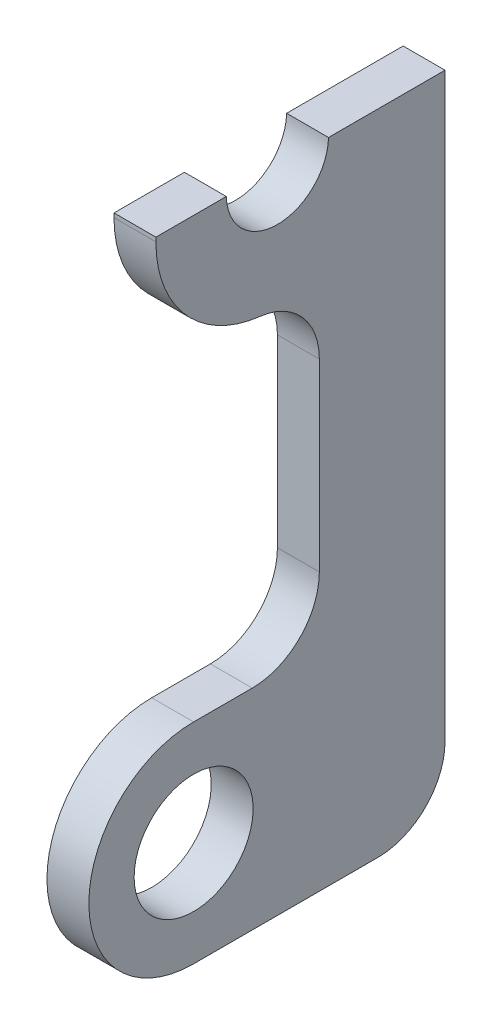
ISO-10303-21;
HEADER;
FILE_DESCRIPTION(('STEP AP214'),'2;1');
FILE_NAME('part.step','',(''),(''),'','','');
FILE_SCHEMA(('AUTOMOTIVE_DESIGN { 1 0 10303 214 1 1 1 1 }'));
ENDSEC;
DATA;
#1=APPLICATION_CONTEXT('core data for automotive mechanical design processes');
#2=APPLICATION_PROTOCOL_DEFINITION('international standard','automotive_design',2000,#1);
#3=PRODUCT_CONTEXT('',#1,'mechanical');
#4=PRODUCT('Part','Part','',(#3));
#5=PRODUCT_RELATED_PRODUCT_CATEGORY('part','',(#4));
#6=PRODUCT_DEFINITION_FORMATION('','',#4);
#7=PRODUCT_DEFINITION_CONTEXT('part definition',#1,'design');
#8=PRODUCT_DEFINITION('design','',#6,#7);
#9=PRODUCT_DEFINITION_SHAPE('','',#8);
#10=(LENGTH_UNIT() NAMED_UNIT(*) SI_UNIT(.MILLI.,.METRE.));
#11=(NAMED_UNIT(*) PLANE_ANGLE_UNIT() SI_UNIT($,.RADIAN.));
#12=(NAMED_UNIT(*) SI_UNIT($,.STERADIAN.) SOLID_ANGLE_UNIT());
#13=UNCERTAINTY_MEASURE_WITH_UNIT(LENGTH_MEASURE(1.E-05),#10,'distance_accuracy_value','');
#14=(GEOMETRIC_REPRESENTATION_CONTEXT(3) GLOBAL_UNCERTAINTY_ASSIGNED_CONTEXT((#13)) GLOBAL_UNIT_ASSIGNED_CONTEXT((#10,
#11,#12)) REPRESENTATION_CONTEXT('',''));
#15=CARTESIAN_POINT('',(0.,0.,0.));
#16=DIRECTION('',(0.,0.,1.));
#17=DIRECTION('',(1.,0.,0.));
#18=AXIS2_PLACEMENT_3D('',#15,#16,#17);
#19=CARTESIAN_POINT('',(5.,65.000000000002,-9.99999999999973));
#20=DIRECTION('',(-1.,0.,0.));
#21=DIRECTION('',(0.,0.,-1.00000000000002));
#22=AXIS2_PLACEMENT_3D('',#19,#20,#21);
#23=CYLINDRICAL_SURFACE('',#22,6.1);
#24=DIRECTION('',(-1.,0.,0.));
#25=VECTOR('',#24,1.);
#26=CARTESIAN_POINT('',(5.,64.8500000000018,-16.098155458825));
#27=LINE('',#26,#25);
#28=CARTESIAN_POINT('',(5.,64.8500000000018,-16.098155458825));
#29=VERTEX_POINT('',#28);
#30=CARTESIAN_POINT('',(0.,64.8500000000018,-16.098155458825));
#31=VERTEX_POINT('',#30);
#32=EDGE_CURVE('E160',#29,#31,#27,.T.);
#33=ORIENTED_EDGE('',*,*,#32,.T.);
#34=CARTESIAN_POINT('',(0.,65.000000000002,-9.99999999999973));
#35=DIRECTION('',(-1.,0.,0.));
#36=DIRECTION('',(0.,0.,1.00000000000002));
#37=AXIS2_PLACEMENT_3D('',#34,#35,#36);
#38=CIRCLE('',#37,6.1);
#39=CARTESIAN_POINT('',(0.,64.8500000000001,-3.90184454117448));
#40=VERTEX_POINT('',#39);
#41=EDGE_CURVE('E137',#31,#40,#38,.T.);
#42=ORIENTED_EDGE('',*,*,#41,.T.);
#43=DIRECTION('',(-1.,0.,0.));
#44=VECTOR('',#43,1.);
#45=CARTESIAN_POINT('',(5.,64.8500000000001,-3.90184454117448));
#46=LINE('',#45,#44);
#47=CARTESIAN_POINT('',(5.,64.8500000000001,-3.90184454117448));
#48=VERTEX_POINT('',#47);
#49=EDGE_CURVE('E405',#40,#48,#46,.F.);
#50=ORIENTED_EDGE('',*,*,#49,.T.);
#51=CARTESIAN_POINT('',(5.,65.000000000002,-9.99999999999973));
#52=DIRECTION('',(-1.,0.,0.));
#53=DIRECTION('',(0.,0.,1.00000000000002));
#54=AXIS2_PLACEMENT_3D('',#51,#52,#53);
#55=CIRCLE('',#54,6.1);
#56=EDGE_CURVE('E178',#29,#48,#55,.T.);
#57=ORIENTED_EDGE('',*,*,#56,.F.);
#58=EDGE_LOOP('',(#33,#42,#50,#57));
#59=FACE_BOUND('',#58,.T.);
#60=ADVANCED_FACE('F38',(#59),#23,.F.);
#61=CARTESIAN_POINT('',(5.,1.13797860024079E-12,-30.0000000000004));
#62=DIRECTION('',(0.,0.,-1.00000000000002));
#63=DIRECTION('',(1.,0.,0.));
#64=AXIS2_PLACEMENT_3D('',#61,#62,#63);
#65=PLANE('',#64);
#66=DIRECTION('',(0.,1.,0.));
#67=VECTOR('',#66,1.);
#68=CARTESIAN_POINT('',(0.,1.13797860024079E-12,-30.0000000000004));
#69=LINE('',#68,#67);
#70=CARTESIAN_POINT('',(0.,-4.49999999999905,-30.0000000000005));
#71=VERTEX_POINT('',#70);
#72=CARTESIAN_POINT('',(0.,64.8500000000006,-29.9999999999997));
#73=VERTEX_POINT('',#72);
#74=EDGE_CURVE('E135',#71,#73,#69,.T.);
#75=ORIENTED_EDGE('',*,*,#74,.T.);
#76=DIRECTION('',(1.,0.,0.));
#77=VECTOR('',#76,1.);
#78=CARTESIAN_POINT('',(0.,64.8500000000006,-29.9999999999997));
#79=LINE('',#78,#77);
#80=CARTESIAN_POINT('',(5.,64.8500000000006,-29.9999999999997));
#81=VERTEX_POINT('',#80);
#82=EDGE_CURVE('E141',#73,#81,#79,.T.);
#83=ORIENTED_EDGE('',*,*,#82,.T.);
#84=DIRECTION('',(0.,1.,0.));
#85=VECTOR('',#84,1.);
#86=CARTESIAN_POINT('',(5.,1.13797860024079E-12,-30.0000000000004));
#87=LINE('',#86,#85);
#88=CARTESIAN_POINT('',(5.,-4.49999999999905,-30.0000000000005));
#89=VERTEX_POINT('',#88);
#90=EDGE_CURVE('E397',#89,#81,#87,.T.);
#91=ORIENTED_EDGE('',*,*,#90,.F.);
#92=DIRECTION('',(-1.,0.,0.));
#93=VECTOR('',#92,1.);
#94=CARTESIAN_POINT('',(5.,-4.49999999999905,-30.0000000000005));
#95=LINE('',#94,#93);
#96=EDGE_CURVE('E154',#71,#89,#95,.F.);
#97=ORIENTED_EDGE('',*,*,#96,.F.);
#98=EDGE_LOOP('',(#75,#83,#91,#97));
#99=FACE_BOUND('',#98,.T.);
#100=ADVANCED_FACE('F152',(#99),#65,.T.);
#101=CARTESIAN_POINT('',(5.,-12.4999999999998,0.));
#102=DIRECTION('',(0.,1.,0.));
#103=DIRECTION('',(0.,0.,-1.00000000000002));
#104=AXIS2_PLACEMENT_3D('',#101,#102,#103);
#105=PLANE('',#104);
#106=DIRECTION('',(0.,0.,1.00000000000002));
#107=VECTOR('',#106,1.);
#108=CARTESIAN_POINT('',(5.,-12.4999999999998,0.));
#109=LINE('',#108,#107);
#110=CARTESIAN_POINT('',(5.,-12.4999999999991,-22.0000000000005));
#111=VERTEX_POINT('',#110);
#112=CARTESIAN_POINT('',(5.,-12.4999999999998,0.));
#113=VERTEX_POINT('',#112);
#114=EDGE_CURVE('E394',#111,#113,#109,.T.);
#115=ORIENTED_EDGE('',*,*,#114,.T.);
#116=DIRECTION('',(-1.,0.,0.));
#117=VECTOR('',#116,1.);
#118=CARTESIAN_POINT('',(5.,-12.4999999999998,0.));
#119=LINE('',#118,#117);
#120=CARTESIAN_POINT('',(0.,-12.4999999999998,0.));
#121=VERTEX_POINT('',#120);
#122=EDGE_CURVE('E182',#113,#121,#119,.T.);
#123=ORIENTED_EDGE('',*,*,#122,.T.);
#124=DIRECTION('',(0.,0.,1.00000000000002));
#125=VECTOR('',#124,1.);
#126=CARTESIAN_POINT('',(0.,-12.4999999999998,0.));
#127=LINE('',#126,#125);
#128=CARTESIAN_POINT('',(0.,-12.4999999999991,-22.0000000000005));
#129=VERTEX_POINT('',#128);
#130=EDGE_CURVE('E155',#129,#121,#127,.T.);
#131=ORIENTED_EDGE('',*,*,#130,.F.);
#132=DIRECTION('',(-1.,0.,0.));
#133=VECTOR('',#132,1.);
#134=CARTESIAN_POINT('',(0.,-12.4999999999991,-22.0000000000005));
#135=LINE('',#134,#133);
#136=EDGE_CURVE('E188',#111,#129,#135,.T.);
#137=ORIENTED_EDGE('',*,*,#136,.F.);
#138=EDGE_LOOP('',(#115,#123,#131,#137));
#139=FACE_BOUND('',#138,.T.);
#140=ADVANCED_FACE('F265',(#139),#105,.F.);
#141=CARTESIAN_POINT('',(5.,0.,0.));
#142=DIRECTION('',(-1.,0.,0.));
#143=DIRECTION('',(0.,0.,-1.00000000000002));
#144=AXIS2_PLACEMENT_3D('',#141,#142,#143);
#145=CYLINDRICAL_SURFACE('',#144,12.5);
#146=CARTESIAN_POINT('',(0.,0.,0.));
#147=DIRECTION('',(-1.,0.,0.));
#148=DIRECTION('',(0.,0.,1.00000000000002));
#149=AXIS2_PLACEMENT_3D('',#146,#147,#148);
#150=CIRCLE('',#149,12.5);
#151=CARTESIAN_POINT('',(0.,12.5,-1.59594559789866E-13));
#152=VERTEX_POINT('',#151);
#153=EDGE_CURVE('E158',#121,#152,#150,.T.);
#154=ORIENTED_EDGE('',*,*,#153,.F.);
#155=ORIENTED_EDGE('',*,*,#122,.F.);
#156=CARTESIAN_POINT('',(5.,0.,0.));
#157=DIRECTION('',(-1.,0.,0.));
#158=DIRECTION('',(0.,0.,1.00000000000002));
#159=AXIS2_PLACEMENT_3D('',#156,#157,#158);
#160=CIRCLE('',#159,12.5);
#161=CARTESIAN_POINT('',(5.,12.5,-1.59594559789866E-13));
#162=VERTEX_POINT('',#161);
#163=EDGE_CURVE('E235',#113,#162,#160,.T.);
#164=ORIENTED_EDGE('',*,*,#163,.T.);
#165=DIRECTION('',(-1.,0.,0.));
#166=VECTOR('',#165,1.);
#167=CARTESIAN_POINT('',(5.,12.5,-1.59594559789866E-13));
#168=LINE('',#167,#166);
#169=EDGE_CURVE('E179',#162,#152,#168,.T.);
#170=ORIENTED_EDGE('',*,*,#169,.T.);
#171=EDGE_LOOP('',(#154,#155,#164,#170));
#172=FACE_BOUND('',#171,.T.);
#173=ADVANCED_FACE('F356',(#172),#145,.T.);
#174=CARTESIAN_POINT('',(5.,12.5,-1.04083408558608E-13));
#175=DIRECTION('',(0.,-1.,0.));
#176=DIRECTION('',(0.,0.,1.00000000000002));
#177=AXIS2_PLACEMENT_3D('',#174,#175,#176);
#178=PLANE('',#177);
#179=DIRECTION('',(0.,0.,-1.00000000000002));
#180=VECTOR('',#179,1.);
#181=CARTESIAN_POINT('',(0.,12.5,-1.04083408558608E-13));
#182=LINE('',#181,#180);
#183=CARTESIAN_POINT('',(0.,12.5,-7.00000000000044));
#184=VERTEX_POINT('',#183);
#185=EDGE_CURVE('E166',#152,#184,#182,.T.);
#186=ORIENTED_EDGE('',*,*,#185,.F.);
#187=ORIENTED_EDGE('',*,*,#169,.F.);
#188=DIRECTION('',(0.,0.,-1.00000000000002));
#189=VECTOR('',#188,1.);
#190=CARTESIAN_POINT('',(5.,12.5,-1.04083408558608E-13));
#191=LINE('',#190,#189);
#192=CARTESIAN_POINT('',(5.,12.5,-7.00000000000044));
#193=VERTEX_POINT('',#192);
#194=EDGE_CURVE('E230',#162,#193,#191,.T.);
#195=ORIENTED_EDGE('',*,*,#194,.T.);
#196=DIRECTION('',(-1.,0.,0.));
#197=VECTOR('',#196,1.);
#198=CARTESIAN_POINT('',(5.,12.5,-7.00000000000044));
#199=LINE('',#198,#197);
#200=EDGE_CURVE('E202',#184,#193,#199,.F.);
#201=ORIENTED_EDGE('',*,*,#200,.F.);
#202=EDGE_LOOP('',(#186,#187,#195,#201));
#203=FACE_BOUND('',#202,.T.);
#204=ADVANCED_FACE('F348',(#203),#178,.F.);
#205=CARTESIAN_POINT('',(5.,1.13797860024079E-12,-15.0000000000003));
#206=DIRECTION('',(0.,0.,1.00000000000002));
#207=DIRECTION('',(0.,1.,0.));
#208=AXIS2_PLACEMENT_3D('',#205,#206,#207);
#209=PLANE('',#208);
#210=DIRECTION('',(0.,-1.,0.));
#211=VECTOR('',#210,1.);
#212=CARTESIAN_POINT('',(5.,1.13797860024079E-12,-15.0000000000003));
#213=LINE('',#212,#211);
#214=CARTESIAN_POINT('',(5.,42.500000000002,-15.0000000000003));
#215=VERTEX_POINT('',#214);
#216=CARTESIAN_POINT('',(5.,20.5000000000011,-15.0000000000003));
#217=VERTEX_POINT('',#216);
#218=EDGE_CURVE('E226',#215,#217,#213,.T.);
#219=ORIENTED_EDGE('',*,*,#218,.F.);
#220=DIRECTION('',(-1.,0.,0.));
#221=VECTOR('',#220,1.);
#222=CARTESIAN_POINT('',(5.,42.500000000002,-15.0000000000003));
#223=LINE('',#222,#221);
#224=CARTESIAN_POINT('',(0.,42.500000000002,-15.0000000000003));
#225=VERTEX_POINT('',#224);
#226=EDGE_CURVE('E196',#225,#215,#223,.F.);
#227=ORIENTED_EDGE('',*,*,#226,.F.);
#228=DIRECTION('',(0.,-1.,0.));
#229=VECTOR('',#228,1.);
#230=CARTESIAN_POINT('',(0.,1.13797860024079E-12,-15.0000000000003));
#231=LINE('',#230,#229);
#232=CARTESIAN_POINT('',(0.,20.5000000000011,-15.0000000000003));
#233=VERTEX_POINT('',#232);
#234=EDGE_CURVE('E169',#225,#233,#231,.T.);
#235=ORIENTED_EDGE('',*,*,#234,.T.);
#236=DIRECTION('',(-1.,0.,0.));
#237=VECTOR('',#236,1.);
#238=CARTESIAN_POINT('',(5.,20.5000000000011,-15.0000000000003));
#239=LINE('',#238,#237);
#240=EDGE_CURVE('E199',#217,#233,#239,.T.);
#241=ORIENTED_EDGE('',*,*,#240,.F.);
#242=EDGE_LOOP('',(#219,#227,#235,#241));
#243=FACE_BOUND('',#242,.T.);
#244=ADVANCED_FACE('F227',(#243),#209,.T.);
#245=CARTESIAN_POINT('',(5.,2.05391259555654E-12,4.5));
#246=DIRECTION('',(0.,0.,1.00000000000002));
#247=DIRECTION('',(0.,1.,0.));
#248=AXIS2_PLACEMENT_3D('',#245,#246,#247);
#249=PLANE('',#248);
#250=DIRECTION('',(0.,-1.,0.));
#251=VECTOR('',#250,1.);
#252=CARTESIAN_POINT('',(5.,2.05391259555654E-12,4.5));
#253=LINE('',#252,#251);
#254=CARTESIAN_POINT('',(5.,64.8500000000003,4.50000000000061));
#255=VERTEX_POINT('',#254);
#256=CARTESIAN_POINT('',(5.,64.3574929943947,4.50000000000061));
#257=VERTEX_POINT('',#256);
#258=EDGE_CURVE('E229',#255,#257,#253,.T.);
#259=ORIENTED_EDGE('',*,*,#258,.F.);
#260=DIRECTION('',(1.,0.,0.));
#261=VECTOR('',#260,1.);
#262=CARTESIAN_POINT('',(0.,64.8500000000003,4.50000000000061));
#263=LINE('',#262,#261);
#264=CARTESIAN_POINT('',(0.,64.8500000000003,4.50000000000061));
#265=VERTEX_POINT('',#264);
#266=EDGE_CURVE('E149',#265,#255,#263,.T.);
#267=ORIENTED_EDGE('',*,*,#266,.F.);
#268=DIRECTION('',(0.,-1.,0.));
#269=VECTOR('',#268,1.);
#270=CARTESIAN_POINT('',(0.,2.05391259555654E-12,4.5));
#271=LINE('',#270,#269);
#272=CARTESIAN_POINT('',(0.,64.3574929943947,4.50000000000061));
#273=VERTEX_POINT('',#272);
#274=EDGE_CURVE('E172',#265,#273,#271,.T.);
#275=ORIENTED_EDGE('',*,*,#274,.T.);
#276=DIRECTION('',(-1.,0.,0.));
#277=VECTOR('',#276,1.);
#278=CARTESIAN_POINT('',(0.,64.3574929943947,4.50000000000061));
#279=LINE('',#278,#277);
#280=EDGE_CURVE('E213',#257,#273,#279,.T.);
#281=ORIENTED_EDGE('',*,*,#280,.F.);
#282=EDGE_LOOP('',(#259,#267,#275,#281));
#283=FACE_BOUND('',#282,.T.);
#284=ADVANCED_FACE('F246',(#283),#249,.T.);
#285=CARTESIAN_POINT('',(5.,0.,0.));
#286=DIRECTION('',(-1.,0.,0.));
#287=DIRECTION('',(0.,0.,-1.00000000000002));
#288=AXIS2_PLACEMENT_3D('',#285,#286,#287);
#289=CYLINDRICAL_SURFACE('',#288,7.1);
#290=CARTESIAN_POINT('',(5.,0.,0.));
#291=DIRECTION('',(-1.,0.,0.));
#292=DIRECTION('',(0.,0.,1.00000000000002));
#293=AXIS2_PLACEMENT_3D('',#290,#291,#292);
#294=CIRCLE('',#293,7.1);
#295=CARTESIAN_POINT('',(5.,0.,7.10000000000007));
#296=VERTEX_POINT('',#295);
#297=EDGE_CURVE('E183',#296,#296,#294,.T.);
#298=ORIENTED_EDGE('',*,*,#297,.F.);
#299=EDGE_LOOP('',(#298));
#300=FACE_BOUND('',#299,.T.);
#301=CARTESIAN_POINT('',(0.,0.,0.));
#302=DIRECTION('',(-1.,0.,0.));
#303=DIRECTION('',(0.,0.,1.00000000000002));
#304=AXIS2_PLACEMENT_3D('',#301,#302,#303);
#305=CIRCLE('',#304,7.1);
#306=CARTESIAN_POINT('',(0.,0.,7.10000000000007));
#307=VERTEX_POINT('',#306);
#308=EDGE_CURVE('E175',#307,#307,#305,.T.);
#309=ORIENTED_EDGE('',*,*,#308,.T.);
#310=EDGE_LOOP('',(#309));
#311=FACE_BOUND('',#310,.T.);
#312=ADVANCED_FACE('F243',(#300,#311),#289,.F.);
#313=CARTESIAN_POINT('',(5.,0.,0.));
#314=DIRECTION('',(1.,0.,0.));
#315=DIRECTION('',(0.,0.,1.00000000000002));
#316=AXIS2_PLACEMENT_3D('',#313,#314,#315);
#317=PLANE('',#316);
#318=CARTESIAN_POINT('',(5.,42.5,-7.00000000000028));
#319=DIRECTION('',(-1.,0.,0.));
#320=DIRECTION('',(0.,0.,1.00000000000002));
#321=AXIS2_PLACEMENT_3D('',#318,#319,#320);
#322=CIRCLE('',#321,8.);
#323=CARTESIAN_POINT('',(5.,50.4481792706908,-7.9090909090903));
#324=VERTEX_POINT('',#323);
#325=EDGE_CURVE('E211',#215,#324,#322,.F.);
#326=ORIENTED_EDGE('',*,*,#325,.F.);
#327=ORIENTED_EDGE('',*,*,#218,.T.);
#328=CARTESIAN_POINT('',(5.,20.5,-7.00000000000023));
#329=DIRECTION('',(-1.,0.,0.));
#330=DIRECTION('',(0.,0.,1.00000000000002));
#331=AXIS2_PLACEMENT_3D('',#328,#329,#330);
#332=CIRCLE('',#331,8.);
#333=EDGE_CURVE('E207',#193,#217,#332,.F.);
#334=ORIENTED_EDGE('',*,*,#333,.F.);
#335=ORIENTED_EDGE('',*,*,#194,.F.);
#336=ORIENTED_EDGE('',*,*,#163,.F.);
#337=ORIENTED_EDGE('',*,*,#114,.F.);
#338=CARTESIAN_POINT('',(5.,-4.49999999999905,-22.0000000000003));
#339=DIRECTION('',(-1.,0.,0.));
#340=DIRECTION('',(0.,0.,1.00000000000002));
#341=AXIS2_PLACEMENT_3D('',#338,#339,#340);
#342=CIRCLE('',#341,8.);
#343=EDGE_CURVE('E194',#89,#111,#342,.T.);
#344=ORIENTED_EDGE('',*,*,#343,.F.);
#345=ORIENTED_EDGE('',*,*,#90,.T.);
#346=DIRECTION('',(0.,0.,1.00000000000002));
#347=VECTOR('',#346,1.);
#348=CARTESIAN_POINT('',(5.,64.8500000000006,-29.9999999999997));
#349=LINE('',#348,#347);
#350=EDGE_CURVE('E142',#81,#29,#349,.T.);
#351=ORIENTED_EDGE('',*,*,#350,.T.);
#352=ORIENTED_EDGE('',*,*,#56,.T.);
#353=EDGE_CURVE('E410',#48,#255,#349,.T.);
#354=ORIENTED_EDGE('',*,*,#353,.T.);
#355=ORIENTED_EDGE('',*,*,#258,.T.);
#356=CARTESIAN_POINT('',(5.,64.3574929943944,-9.49999999999973));
#357=DIRECTION('',(-1.,0.,0.));
#358=DIRECTION('',(0.,0.,1.00000000000002));
#359=AXIS2_PLACEMENT_3D('',#356,#357,#358);
#360=CIRCLE('',#359,14.);
#361=EDGE_CURVE('E11',#324,#257,#360,.T.);
#362=ORIENTED_EDGE('',*,*,#361,.F.);
#363=EDGE_LOOP('',(#326,#327,#334,#335,#336,#337,#344,#345,#351,#352,#354,#355,#362));
#364=FACE_BOUND('',#363,.T.);
#365=ORIENTED_EDGE('',*,*,#297,.T.);
#366=EDGE_LOOP('',(#365));
#367=FACE_BOUND('',#366,.T.);
#368=ADVANCED_FACE('F241',(#364,#367),#317,.T.);
#369=CARTESIAN_POINT('',(0.,0.,0.));
#370=DIRECTION('',(1.,0.,0.));
#371=DIRECTION('',(0.,0.,1.00000000000002));
#372=AXIS2_PLACEMENT_3D('',#369,#370,#371);
#373=PLANE('',#372);
#374=ORIENTED_EDGE('',*,*,#274,.F.);
#375=DIRECTION('',(0.,0.,1.00000000000002));
#376=VECTOR('',#375,1.);
#377=CARTESIAN_POINT('',(0.,64.85,6.10622663543836E-13));
#378=LINE('',#377,#376);
#379=EDGE_CURVE('E186',#40,#265,#378,.T.);
#380=ORIENTED_EDGE('',*,*,#379,.F.);
#381=ORIENTED_EDGE('',*,*,#41,.F.);
#382=DIRECTION('',(0.,0.,1.00000000000002));
#383=VECTOR('',#382,1.);
#384=CARTESIAN_POINT('',(0.,64.8500000000006,-29.9999999999997));
#385=LINE('',#384,#383);
#386=EDGE_CURVE('E129',#73,#31,#385,.T.);
#387=ORIENTED_EDGE('',*,*,#386,.F.);
#388=ORIENTED_EDGE('',*,*,#74,.F.);
#389=CARTESIAN_POINT('',(0.,-4.49999999999905,-22.0000000000003));
#390=DIRECTION('',(-1.,0.,0.));
#391=DIRECTION('',(0.,0.,1.00000000000002));
#392=AXIS2_PLACEMENT_3D('',#389,#390,#391);
#393=CIRCLE('',#392,8.);
#394=EDGE_CURVE('E191',#129,#71,#393,.F.);
#395=ORIENTED_EDGE('',*,*,#394,.F.);
#396=ORIENTED_EDGE('',*,*,#130,.T.);
#397=ORIENTED_EDGE('',*,*,#153,.T.);
#398=ORIENTED_EDGE('',*,*,#185,.T.);
#399=CARTESIAN_POINT('',(0.,20.5,-7.00000000000023));
#400=DIRECTION('',(-1.,0.,0.));
#401=DIRECTION('',(0.,0.,1.00000000000002));
#402=AXIS2_PLACEMENT_3D('',#399,#400,#401);
#403=CIRCLE('',#402,8.);
#404=EDGE_CURVE('E205',#233,#184,#403,.T.);
#405=ORIENTED_EDGE('',*,*,#404,.F.);
#406=ORIENTED_EDGE('',*,*,#234,.F.);
#407=CARTESIAN_POINT('',(0.,42.5,-7.00000000000028));
#408=DIRECTION('',(-1.,0.,0.));
#409=DIRECTION('',(0.,0.,1.00000000000002));
#410=AXIS2_PLACEMENT_3D('',#407,#408,#409);
#411=CIRCLE('',#410,8.);
#412=CARTESIAN_POINT('',(0.,50.4481792706908,-7.9090909090903));
#413=VERTEX_POINT('',#412);
#414=EDGE_CURVE('E209',#413,#225,#411,.T.);
#415=ORIENTED_EDGE('',*,*,#414,.F.);
#416=CARTESIAN_POINT('',(0.,64.3574929943944,-9.49999999999973));
#417=DIRECTION('',(-1.,0.,0.));
#418=DIRECTION('',(0.,0.,1.00000000000002));
#419=AXIS2_PLACEMENT_3D('',#416,#417,#418);
#420=CIRCLE('',#419,14.);
#421=EDGE_CURVE('E216',#273,#413,#420,.F.);
#422=ORIENTED_EDGE('',*,*,#421,.F.);
#423=EDGE_LOOP('',(#374,#380,#381,#387,#388,#395,#396,#397,#398,#405,#406,#415,#422));
#424=FACE_BOUND('',#423,.T.);
#425=ORIENTED_EDGE('',*,*,#308,.F.);
#426=EDGE_LOOP('',(#425));
#427=FACE_BOUND('',#426,.T.);
#428=ADVANCED_FACE('F132',(#424,#427),#373,.F.);
#429=CARTESIAN_POINT('',(0.,64.8500000000006,-29.9999999999997));
#430=DIRECTION('',(0.,-1.,0.));
#431=DIRECTION('',(0.,0.,1.00000000000002));
#432=AXIS2_PLACEMENT_3D('',#429,#430,#431);
#433=PLANE('',#432);
#434=ORIENTED_EDGE('',*,*,#49,.F.);
#435=ORIENTED_EDGE('',*,*,#379,.T.);
#436=ORIENTED_EDGE('',*,*,#266,.T.);
#437=ORIENTED_EDGE('',*,*,#353,.F.);
#438=EDGE_LOOP('',(#434,#435,#436,#437));
#439=FACE_BOUND('',#438,.T.);
#440=ADVANCED_FACE('F250',(#439),#433,.F.);
#441=ORIENTED_EDGE('',*,*,#32,.F.);
#442=ORIENTED_EDGE('',*,*,#350,.F.);
#443=ORIENTED_EDGE('',*,*,#82,.F.);
#444=ORIENTED_EDGE('',*,*,#386,.T.);
#445=EDGE_LOOP('',(#441,#442,#443,#444));
#446=FACE_BOUND('',#445,.T.);
#447=ADVANCED_FACE('F145',(#446),#433,.F.);
#448=CARTESIAN_POINT('',(5.,-4.49999999999905,-22.0000000000003));
#449=DIRECTION('',(1.,0.,0.));
#450=DIRECTION('',(0.,0.,1.00000000000002));
#451=AXIS2_PLACEMENT_3D('',#448,#449,#450);
#452=CYLINDRICAL_SURFACE('',#451,8.);
#453=ORIENTED_EDGE('',*,*,#343,.T.);
#454=ORIENTED_EDGE('',*,*,#136,.T.);
#455=ORIENTED_EDGE('',*,*,#394,.T.);
#456=ORIENTED_EDGE('',*,*,#96,.T.);
#457=EDGE_LOOP('',(#453,#454,#455,#456));
#458=FACE_BOUND('',#457,.T.);
#459=ADVANCED_FACE('F269',(#458),#452,.T.);
#460=CARTESIAN_POINT('',(5.,20.5,-7.00000000000023));
#461=DIRECTION('',(-1.,0.,0.));
#462=DIRECTION('',(0.,0.,-1.00000000000002));
#463=AXIS2_PLACEMENT_3D('',#460,#461,#462);
#464=CYLINDRICAL_SURFACE('',#463,8.);
#465=ORIENTED_EDGE('',*,*,#333,.T.);
#466=ORIENTED_EDGE('',*,*,#240,.T.);
#467=ORIENTED_EDGE('',*,*,#404,.T.);
#468=ORIENTED_EDGE('',*,*,#200,.T.);
#469=EDGE_LOOP('',(#465,#466,#467,#468));
#470=FACE_BOUND('',#469,.T.);
#471=ADVANCED_FACE('F272',(#470),#464,.F.);
#472=CARTESIAN_POINT('',(5.,42.5,-7.00000000000028));
#473=DIRECTION('',(1.,0.,0.));
#474=DIRECTION('',(0.,0.,1.00000000000002));
#475=AXIS2_PLACEMENT_3D('',#472,#473,#474);
#476=CYLINDRICAL_SURFACE('',#475,8.);
#477=ORIENTED_EDGE('',*,*,#414,.T.);
#478=ORIENTED_EDGE('',*,*,#226,.T.);
#479=ORIENTED_EDGE('',*,*,#325,.T.);
#480=DIRECTION('',(1.,0.,0.));
#481=VECTOR('',#480,1.);
#482=CARTESIAN_POINT('',(5.,50.4481792706908,-7.9090909090903));
#483=LINE('',#482,#481);
#484=EDGE_CURVE('E46',#413,#324,#483,.T.);
#485=ORIENTED_EDGE('',*,*,#484,.F.);
#486=EDGE_LOOP('',(#477,#478,#479,#485));
#487=FACE_BOUND('',#486,.T.);
#488=ADVANCED_FACE('F221',(#487),#476,.F.);
#489=CARTESIAN_POINT('',(5.,64.3574929943944,-9.49999999999973));
#490=DIRECTION('',(1.,0.,0.));
#491=DIRECTION('',(0.,0.,1.00000000000002));
#492=AXIS2_PLACEMENT_3D('',#489,#490,#491);
#493=CYLINDRICAL_SURFACE('',#492,14.);
#494=ORIENTED_EDGE('',*,*,#361,.T.);
#495=ORIENTED_EDGE('',*,*,#280,.T.);
#496=ORIENTED_EDGE('',*,*,#421,.T.);
#497=ORIENTED_EDGE('',*,*,#484,.T.);
#498=EDGE_LOOP('',(#494,#495,#496,#497));
#499=FACE_BOUND('',#498,.T.);
#500=ADVANCED_FACE('F40',(#499),#493,.T.);
#501=CLOSED_SHELL('',(#60,#100,#140,#173,#204,#244,#284,#312,#368,#428,#440,#447,#459,#471,#488,#500));
#502=MANIFOLD_SOLID_BREP('B2',#501);
#503=ADVANCED_BREP_SHAPE_REPRESENTATION('',(#18,#502),#14);
#504=SHAPE_DEFINITION_REPRESENTATION(#9,#503);
ENDSEC;
END-ISO-10303-21;
